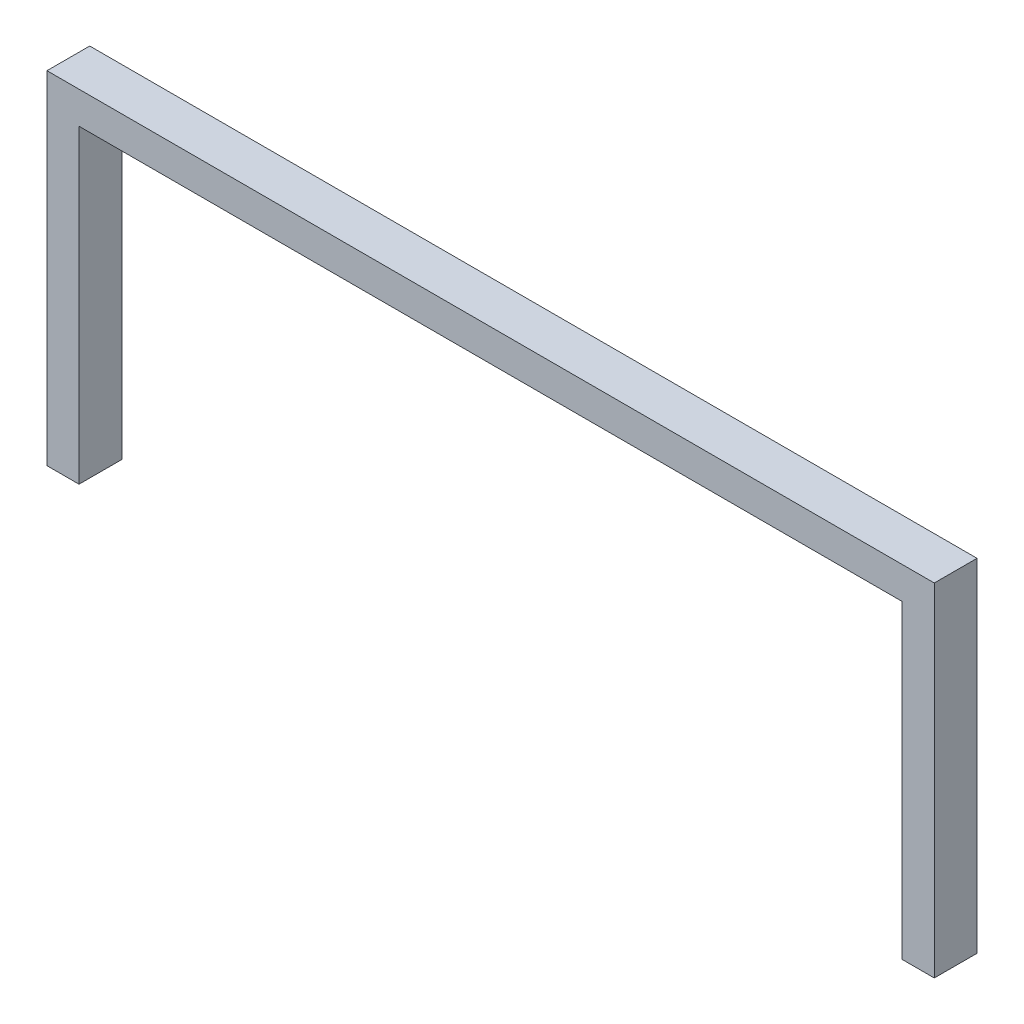
ISO-10303-21;
HEADER;
FILE_DESCRIPTION(('STEP AP214'),'2;1');
FILE_NAME('part.step','',(''),(''),'','','');
FILE_SCHEMA(('AUTOMOTIVE_DESIGN { 1 0 10303 214 1 1 1 1 }'));
ENDSEC;
DATA;
#1=APPLICATION_CONTEXT('core data for automotive mechanical design processes');
#2=APPLICATION_PROTOCOL_DEFINITION('international standard','automotive_design',2000,#1);
#3=PRODUCT_CONTEXT('',#1,'mechanical');
#4=PRODUCT('Part','Part','',(#3));
#5=PRODUCT_RELATED_PRODUCT_CATEGORY('part','',(#4));
#6=PRODUCT_DEFINITION_FORMATION('','',#4);
#7=PRODUCT_DEFINITION_CONTEXT('part definition',#1,'design');
#8=PRODUCT_DEFINITION('design','',#6,#7);
#9=PRODUCT_DEFINITION_SHAPE('','',#8);
#10=(LENGTH_UNIT() NAMED_UNIT(*) SI_UNIT(.MILLI.,.METRE.));
#11=(NAMED_UNIT(*) PLANE_ANGLE_UNIT() SI_UNIT($,.RADIAN.));
#12=(NAMED_UNIT(*) SI_UNIT($,.STERADIAN.) SOLID_ANGLE_UNIT());
#13=UNCERTAINTY_MEASURE_WITH_UNIT(LENGTH_MEASURE(1.E-05),#10,'distance_accuracy_value','');
#14=(GEOMETRIC_REPRESENTATION_CONTEXT(3) GLOBAL_UNCERTAINTY_ASSIGNED_CONTEXT((#13)) GLOBAL_UNIT_ASSIGNED_CONTEXT((#10,
#11,#12)) REPRESENTATION_CONTEXT('',''));
#15=CARTESIAN_POINT('',(0.,0.,0.));
#16=DIRECTION('',(0.,0.,1.));
#17=DIRECTION('',(1.,0.,0.));
#18=AXIS2_PLACEMENT_3D('',#15,#16,#17);
#19=CARTESIAN_POINT('',(0.,29.,4.));
#20=DIRECTION('',(-1.,0.,0.));
#21=DIRECTION('',(0.,-1.,0.));
#22=AXIS2_PLACEMENT_3D('',#19,#20,#21);
#23=PLANE('',#22);
#24=DIRECTION('',(0.,1.,0.));
#25=VECTOR('',#24,1.);
#26=CARTESIAN_POINT('',(0.,29.,0.));
#27=LINE('',#26,#25);
#28=CARTESIAN_POINT('',(0.,0.,0.));
#29=VERTEX_POINT('',#28);
#30=CARTESIAN_POINT('',(0.,29.,0.));
#31=VERTEX_POINT('',#30);
#32=EDGE_CURVE('E140',#29,#31,#27,.T.);
#33=ORIENTED_EDGE('',*,*,#32,.T.);
#34=DIRECTION('',(0.,0.,-1.));
#35=VECTOR('',#34,1.);
#36=CARTESIAN_POINT('',(0.,29.,4.));
#37=LINE('',#36,#35);
#38=CARTESIAN_POINT('',(0.,29.,4.));
#39=VERTEX_POINT('',#38);
#40=EDGE_CURVE('E11',#39,#31,#37,.T.);
#41=ORIENTED_EDGE('',*,*,#40,.F.);
#42=DIRECTION('',(0.,1.,0.));
#43=VECTOR('',#42,1.);
#44=CARTESIAN_POINT('',(0.,29.,4.));
#45=LINE('',#44,#43);
#46=CARTESIAN_POINT('',(0.,0.,4.));
#47=VERTEX_POINT('',#46);
#48=EDGE_CURVE('E162',#47,#39,#45,.T.);
#49=ORIENTED_EDGE('',*,*,#48,.F.);
#50=DIRECTION('',(0.,0.,-1.));
#51=VECTOR('',#50,1.);
#52=CARTESIAN_POINT('',(0.,0.,4.));
#53=LINE('',#52,#51);
#54=EDGE_CURVE('E136',#47,#29,#53,.T.);
#55=ORIENTED_EDGE('',*,*,#54,.T.);
#56=EDGE_LOOP('',(#33,#41,#49,#55));
#57=FACE_BOUND('',#56,.T.);
#58=ADVANCED_FACE('F39',(#57),#23,.F.);
#59=CARTESIAN_POINT('',(77.,29.,4.));
#60=DIRECTION('',(0.,1.,0.));
#61=DIRECTION('',(-1.,0.,0.));
#62=AXIS2_PLACEMENT_3D('',#59,#60,#61);
#63=PLANE('',#62);
#64=DIRECTION('',(1.,0.,0.));
#65=VECTOR('',#64,1.);
#66=CARTESIAN_POINT('',(77.,29.,0.));
#67=LINE('',#66,#65);
#68=CARTESIAN_POINT('',(77.,29.,0.));
#69=VERTEX_POINT('',#68);
#70=EDGE_CURVE('E144',#31,#69,#67,.T.);
#71=ORIENTED_EDGE('',*,*,#70,.T.);
#72=DIRECTION('',(0.,0.,-1.));
#73=VECTOR('',#72,1.);
#74=CARTESIAN_POINT('',(77.,29.,4.));
#75=LINE('',#74,#73);
#76=CARTESIAN_POINT('',(77.,29.,4.));
#77=VERTEX_POINT('',#76);
#78=EDGE_CURVE('E48',#77,#69,#75,.T.);
#79=ORIENTED_EDGE('',*,*,#78,.F.);
#80=DIRECTION('',(1.,0.,0.));
#81=VECTOR('',#80,1.);
#82=CARTESIAN_POINT('',(77.,29.,4.));
#83=LINE('',#82,#81);
#84=EDGE_CURVE('E99',#39,#77,#83,.T.);
#85=ORIENTED_EDGE('',*,*,#84,.F.);
#86=ORIENTED_EDGE('',*,*,#40,.T.);
#87=EDGE_LOOP('',(#71,#79,#85,#86));
#88=FACE_BOUND('',#87,.T.);
#89=ADVANCED_FACE('F208',(#88),#63,.F.);
#90=CARTESIAN_POINT('',(77.,0.,4.));
#91=DIRECTION('',(1.,0.,0.));
#92=DIRECTION('',(0.,0.,-1.));
#93=AXIS2_PLACEMENT_3D('',#90,#91,#92);
#94=PLANE('',#93);
#95=DIRECTION('',(0.,-1.,0.));
#96=VECTOR('',#95,1.);
#97=CARTESIAN_POINT('',(77.,0.,0.));
#98=LINE('',#97,#96);
#99=CARTESIAN_POINT('',(77.,0.,0.));
#100=VERTEX_POINT('',#99);
#101=EDGE_CURVE('E147',#69,#100,#98,.T.);
#102=ORIENTED_EDGE('',*,*,#101,.T.);
#103=DIRECTION('',(0.,0.,-1.));
#104=VECTOR('',#103,1.);
#105=CARTESIAN_POINT('',(77.,0.,4.));
#106=LINE('',#105,#104);
#107=CARTESIAN_POINT('',(77.,0.,4.));
#108=VERTEX_POINT('',#107);
#109=EDGE_CURVE('E173',#108,#100,#106,.T.);
#110=ORIENTED_EDGE('',*,*,#109,.F.);
#111=DIRECTION('',(0.,-1.,0.));
#112=VECTOR('',#111,1.);
#113=CARTESIAN_POINT('',(77.,0.,4.));
#114=LINE('',#113,#112);
#115=EDGE_CURVE('E183',#77,#108,#114,.T.);
#116=ORIENTED_EDGE('',*,*,#115,.F.);
#117=ORIENTED_EDGE('',*,*,#78,.T.);
#118=EDGE_LOOP('',(#102,#110,#116,#117));
#119=FACE_BOUND('',#118,.T.);
#120=ADVANCED_FACE('F181',(#119),#94,.F.);
#121=CARTESIAN_POINT('',(80.,0.,4.));
#122=DIRECTION('',(0.,1.,0.));
#123=DIRECTION('',(-1.,0.,0.));
#124=AXIS2_PLACEMENT_3D('',#121,#122,#123);
#125=PLANE('',#124);
#126=DIRECTION('',(1.,0.,0.));
#127=VECTOR('',#126,1.);
#128=CARTESIAN_POINT('',(80.,0.,0.));
#129=LINE('',#128,#127);
#130=CARTESIAN_POINT('',(80.,0.,0.));
#131=VERTEX_POINT('',#130);
#132=EDGE_CURVE('E150',#100,#131,#129,.T.);
#133=ORIENTED_EDGE('',*,*,#132,.T.);
#134=DIRECTION('',(0.,0.,-1.));
#135=VECTOR('',#134,1.);
#136=CARTESIAN_POINT('',(80.,0.,4.));
#137=LINE('',#136,#135);
#138=CARTESIAN_POINT('',(80.,0.,4.));
#139=VERTEX_POINT('',#138);
#140=EDGE_CURVE('E169',#139,#131,#137,.T.);
#141=ORIENTED_EDGE('',*,*,#140,.F.);
#142=DIRECTION('',(1.,0.,0.));
#143=VECTOR('',#142,1.);
#144=CARTESIAN_POINT('',(80.,0.,4.));
#145=LINE('',#144,#143);
#146=EDGE_CURVE('E196',#108,#139,#145,.T.);
#147=ORIENTED_EDGE('',*,*,#146,.F.);
#148=ORIENTED_EDGE('',*,*,#109,.T.);
#149=EDGE_LOOP('',(#133,#141,#147,#148));
#150=FACE_BOUND('',#149,.T.);
#151=ADVANCED_FACE('F191',(#150),#125,.F.);
#152=CARTESIAN_POINT('',(80.,32.,4.));
#153=DIRECTION('',(-1.,0.,0.));
#154=DIRECTION('',(0.,0.,1.));
#155=AXIS2_PLACEMENT_3D('',#152,#153,#154);
#156=PLANE('',#155);
#157=DIRECTION('',(0.,1.,0.));
#158=VECTOR('',#157,1.);
#159=CARTESIAN_POINT('',(80.,32.,0.));
#160=LINE('',#159,#158);
#161=CARTESIAN_POINT('',(80.,32.,0.));
#162=VERTEX_POINT('',#161);
#163=EDGE_CURVE('E153',#131,#162,#160,.T.);
#164=ORIENTED_EDGE('',*,*,#163,.T.);
#165=DIRECTION('',(0.,0.,-1.));
#166=VECTOR('',#165,1.);
#167=CARTESIAN_POINT('',(80.,32.,4.));
#168=LINE('',#167,#166);
#169=CARTESIAN_POINT('',(80.,32.,4.));
#170=VERTEX_POINT('',#169);
#171=EDGE_CURVE('E129',#170,#162,#168,.T.);
#172=ORIENTED_EDGE('',*,*,#171,.F.);
#173=DIRECTION('',(0.,1.,0.));
#174=VECTOR('',#173,1.);
#175=CARTESIAN_POINT('',(80.,32.,4.));
#176=LINE('',#175,#174);
#177=EDGE_CURVE('E118',#139,#170,#176,.T.);
#178=ORIENTED_EDGE('',*,*,#177,.F.);
#179=ORIENTED_EDGE('',*,*,#140,.T.);
#180=EDGE_LOOP('',(#164,#172,#178,#179));
#181=FACE_BOUND('',#180,.T.);
#182=ADVANCED_FACE('F194',(#181),#156,.F.);
#183=CARTESIAN_POINT('',(-3.00000000000001,32.,4.));
#184=DIRECTION('',(0.,-1.,0.));
#185=DIRECTION('',(0.,0.,-1.));
#186=AXIS2_PLACEMENT_3D('',#183,#184,#185);
#187=PLANE('',#186);
#188=DIRECTION('',(-1.,0.,0.));
#189=VECTOR('',#188,1.);
#190=CARTESIAN_POINT('',(-3.00000000000001,32.,0.));
#191=LINE('',#190,#189);
#192=CARTESIAN_POINT('',(-3.00000000000001,32.,0.));
#193=VERTEX_POINT('',#192);
#194=EDGE_CURVE('E127',#162,#193,#191,.T.);
#195=ORIENTED_EDGE('',*,*,#194,.T.);
#196=DIRECTION('',(0.,0.,-1.));
#197=VECTOR('',#196,1.);
#198=CARTESIAN_POINT('',(-3.00000000000001,32.,4.));
#199=LINE('',#198,#197);
#200=CARTESIAN_POINT('',(-3.00000000000001,32.,4.));
#201=VERTEX_POINT('',#200);
#202=EDGE_CURVE('E124',#201,#193,#199,.T.);
#203=ORIENTED_EDGE('',*,*,#202,.F.);
#204=DIRECTION('',(-1.,0.,0.));
#205=VECTOR('',#204,1.);
#206=CARTESIAN_POINT('',(-3.00000000000001,32.,4.));
#207=LINE('',#206,#205);
#208=EDGE_CURVE('E112',#170,#201,#207,.T.);
#209=ORIENTED_EDGE('',*,*,#208,.F.);
#210=ORIENTED_EDGE('',*,*,#171,.T.);
#211=EDGE_LOOP('',(#195,#203,#209,#210));
#212=FACE_BOUND('',#211,.T.);
#213=ADVANCED_FACE('F125',(#212),#187,.F.);
#214=CARTESIAN_POINT('',(-3.00000000000001,0.,4.));
#215=DIRECTION('',(1.,0.,0.));
#216=DIRECTION('',(0.,0.,-1.));
#217=AXIS2_PLACEMENT_3D('',#214,#215,#216);
#218=PLANE('',#217);
#219=DIRECTION('',(0.,-1.,0.));
#220=VECTOR('',#219,1.);
#221=CARTESIAN_POINT('',(-3.00000000000001,0.,0.));
#222=LINE('',#221,#220);
#223=CARTESIAN_POINT('',(-3.00000000000001,0.,0.));
#224=VERTEX_POINT('',#223);
#225=EDGE_CURVE('E85',#193,#224,#222,.T.);
#226=ORIENTED_EDGE('',*,*,#225,.T.);
#227=DIRECTION('',(0.,0.,-1.));
#228=VECTOR('',#227,1.);
#229=CARTESIAN_POINT('',(-3.00000000000001,0.,4.));
#230=LINE('',#229,#228);
#231=CARTESIAN_POINT('',(-3.00000000000001,0.,4.));
#232=VERTEX_POINT('',#231);
#233=EDGE_CURVE('E130',#232,#224,#230,.T.);
#234=ORIENTED_EDGE('',*,*,#233,.F.);
#235=DIRECTION('',(0.,-1.,0.));
#236=VECTOR('',#235,1.);
#237=CARTESIAN_POINT('',(-3.00000000000001,0.,4.));
#238=LINE('',#237,#236);
#239=EDGE_CURVE('E116',#201,#232,#238,.T.);
#240=ORIENTED_EDGE('',*,*,#239,.F.);
#241=ORIENTED_EDGE('',*,*,#202,.T.);
#242=EDGE_LOOP('',(#226,#234,#240,#241));
#243=FACE_BOUND('',#242,.T.);
#244=ADVANCED_FACE('F132',(#243),#218,.F.);
#245=CARTESIAN_POINT('',(0.,0.,4.));
#246=DIRECTION('',(0.,1.,0.));
#247=DIRECTION('',(-1.,0.,0.));
#248=AXIS2_PLACEMENT_3D('',#245,#246,#247);
#249=PLANE('',#248);
#250=DIRECTION('',(1.,0.,0.));
#251=VECTOR('',#250,1.);
#252=CARTESIAN_POINT('',(0.,0.,0.));
#253=LINE('',#252,#251);
#254=EDGE_CURVE('E91',#224,#29,#253,.T.);
#255=ORIENTED_EDGE('',*,*,#254,.T.);
#256=ORIENTED_EDGE('',*,*,#54,.F.);
#257=DIRECTION('',(1.,0.,0.));
#258=VECTOR('',#257,1.);
#259=CARTESIAN_POINT('',(0.,0.,4.));
#260=LINE('',#259,#258);
#261=EDGE_CURVE('E56',#232,#47,#260,.T.);
#262=ORIENTED_EDGE('',*,*,#261,.F.);
#263=ORIENTED_EDGE('',*,*,#233,.T.);
#264=EDGE_LOOP('',(#255,#256,#262,#263));
#265=FACE_BOUND('',#264,.T.);
#266=ADVANCED_FACE('F224',(#265),#249,.F.);
#267=CARTESIAN_POINT('',(0.,0.,4.));
#268=DIRECTION('',(0.,0.,-1.));
#269=DIRECTION('',(-1.,0.,0.));
#270=AXIS2_PLACEMENT_3D('',#267,#268,#269);
#271=PLANE('',#270);
#272=ORIENTED_EDGE('',*,*,#48,.T.);
#273=ORIENTED_EDGE('',*,*,#84,.T.);
#274=ORIENTED_EDGE('',*,*,#115,.T.);
#275=ORIENTED_EDGE('',*,*,#146,.T.);
#276=ORIENTED_EDGE('',*,*,#177,.T.);
#277=ORIENTED_EDGE('',*,*,#208,.T.);
#278=ORIENTED_EDGE('',*,*,#239,.T.);
#279=ORIENTED_EDGE('',*,*,#261,.T.);
#280=EDGE_LOOP('',(#272,#273,#274,#275,#276,#277,#278,#279));
#281=FACE_BOUND('',#280,.T.);
#282=ADVANCED_FACE('F114',(#281),#271,.F.);
#283=CARTESIAN_POINT('',(0.,0.,0.));
#284=DIRECTION('',(0.,0.,-1.));
#285=DIRECTION('',(-1.,0.,0.));
#286=AXIS2_PLACEMENT_3D('',#283,#284,#285);
#287=PLANE('',#286);
#288=ORIENTED_EDGE('',*,*,#32,.F.);
#289=ORIENTED_EDGE('',*,*,#254,.F.);
#290=ORIENTED_EDGE('',*,*,#225,.F.);
#291=ORIENTED_EDGE('',*,*,#194,.F.);
#292=ORIENTED_EDGE('',*,*,#163,.F.);
#293=ORIENTED_EDGE('',*,*,#132,.F.);
#294=ORIENTED_EDGE('',*,*,#101,.F.);
#295=ORIENTED_EDGE('',*,*,#70,.F.);
#296=EDGE_LOOP('',(#288,#289,#290,#291,#292,#293,#294,#295));
#297=FACE_BOUND('',#296,.T.);
#298=ADVANCED_FACE('F187',(#297),#287,.T.);
#299=CLOSED_SHELL('',(#58,#89,#120,#151,#182,#213,#244,#266,#282,#298));
#300=MANIFOLD_SOLID_BREP('B2',#299);
#301=ADVANCED_BREP_SHAPE_REPRESENTATION('',(#18,#300),#14);
#302=SHAPE_DEFINITION_REPRESENTATION(#9,#301);
ENDSEC;
END-ISO-10303-21;
